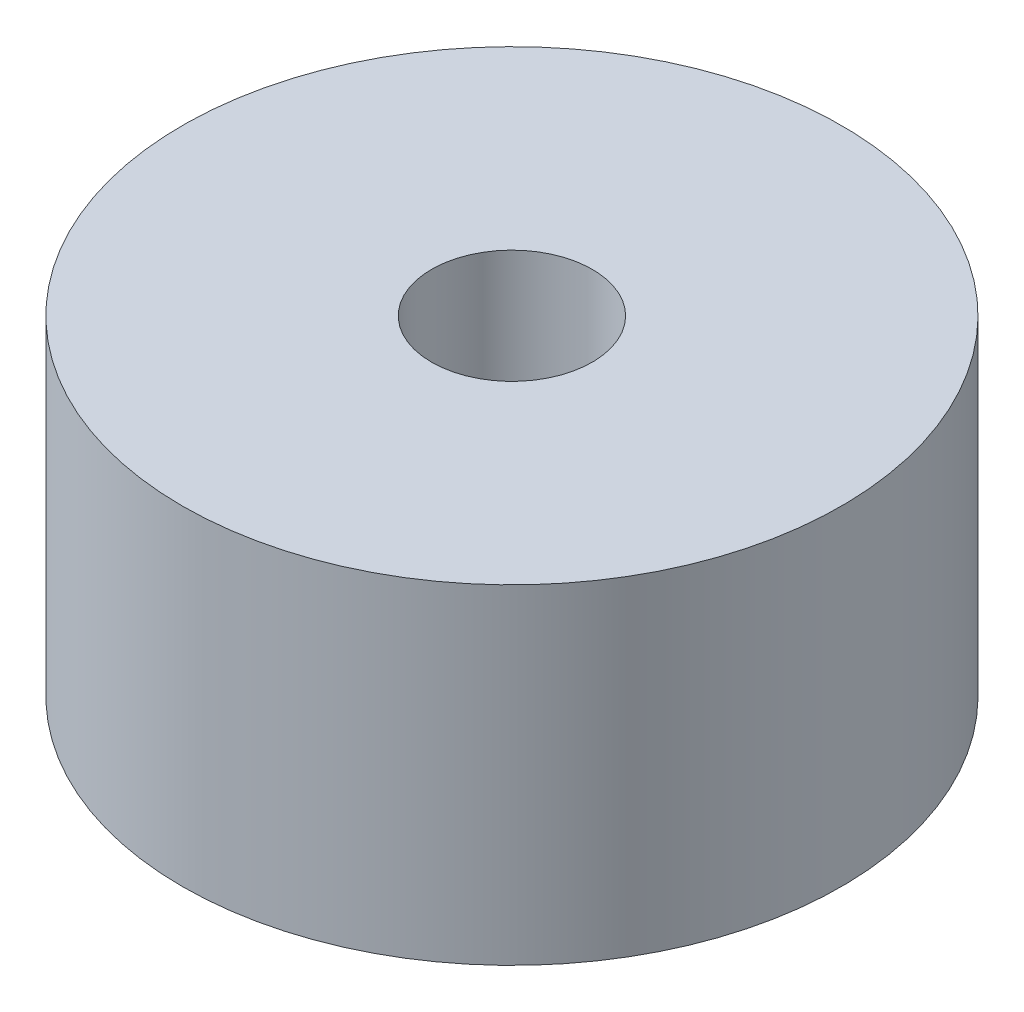
ISO-10303-21;
HEADER;
FILE_DESCRIPTION(('STEP AP214'),'2;1');
FILE_NAME('part.step','',(''),(''),'','','');
FILE_SCHEMA(('AUTOMOTIVE_DESIGN { 1 0 10303 214 1 1 1 1 }'));
ENDSEC;
DATA;
#1=APPLICATION_CONTEXT('core data for automotive mechanical design processes');
#2=APPLICATION_PROTOCOL_DEFINITION('international standard','automotive_design',2000,#1);
#3=PRODUCT_CONTEXT('',#1,'mechanical');
#4=PRODUCT('Part','Part','',(#3));
#5=PRODUCT_RELATED_PRODUCT_CATEGORY('part','',(#4));
#6=PRODUCT_DEFINITION_FORMATION('','',#4);
#7=PRODUCT_DEFINITION_CONTEXT('part definition',#1,'design');
#8=PRODUCT_DEFINITION('design','',#6,#7);
#9=PRODUCT_DEFINITION_SHAPE('','',#8);
#10=(LENGTH_UNIT() NAMED_UNIT(*) SI_UNIT(.MILLI.,.METRE.));
#11=(NAMED_UNIT(*) PLANE_ANGLE_UNIT() SI_UNIT($,.RADIAN.));
#12=(NAMED_UNIT(*) SI_UNIT($,.STERADIAN.) SOLID_ANGLE_UNIT());
#13=UNCERTAINTY_MEASURE_WITH_UNIT(LENGTH_MEASURE(1.E-05),#10,'distance_accuracy_value','');
#14=(GEOMETRIC_REPRESENTATION_CONTEXT(3) GLOBAL_UNCERTAINTY_ASSIGNED_CONTEXT((#13)) GLOBAL_UNIT_ASSIGNED_CONTEXT((#10,
#11,#12)) REPRESENTATION_CONTEXT('',''));
#15=CARTESIAN_POINT('',(0.,0.,0.));
#16=DIRECTION('',(0.,0.,1.));
#17=DIRECTION('',(1.,0.,0.));
#18=AXIS2_PLACEMENT_3D('',#15,#16,#17);
#19=CARTESIAN_POINT('',(0.,6.35,0.));
#20=DIRECTION('',(0.,1.,0.));
#21=DIRECTION('',(0.,0.,1.));
#22=AXIS2_PLACEMENT_3D('',#19,#20,#21);
#23=PLANE('',#22);
#24=CARTESIAN_POINT('',(0.,6.35,0.));
#25=DIRECTION('',(0.,1.,0.));
#26=DIRECTION('',(0.,0.,1.));
#27=AXIS2_PLACEMENT_3D('',#24,#25,#26);
#28=CIRCLE('',#27,6.35);
#29=CARTESIAN_POINT('',(0.,6.35,6.35));
#30=VERTEX_POINT('',#29);
#31=EDGE_CURVE('E10',#30,#30,#28,.T.);
#32=ORIENTED_EDGE('',*,*,#31,.T.);
#33=EDGE_LOOP('',(#32));
#34=FACE_BOUND('',#33,.T.);
#35=CARTESIAN_POINT('',(0.,6.35,0.));
#36=DIRECTION('',(0.,1.,0.));
#37=DIRECTION('',(0.,0.,1.));
#38=AXIS2_PLACEMENT_3D('',#35,#36,#37);
#39=CIRCLE('',#38,1.5494);
#40=CARTESIAN_POINT('',(0.,6.35,1.5494));
#41=VERTEX_POINT('',#40);
#42=EDGE_CURVE('E49',#41,#41,#39,.T.);
#43=ORIENTED_EDGE('',*,*,#42,.F.);
#44=EDGE_LOOP('',(#43));
#45=FACE_BOUND('',#44,.T.);
#46=ADVANCED_FACE('F36',(#34,#45),#23,.T.);
#47=CARTESIAN_POINT('',(0.,0.,0.));
#48=DIRECTION('',(0.,1.,0.));
#49=DIRECTION('',(0.,0.,1.));
#50=AXIS2_PLACEMENT_3D('',#47,#48,#49);
#51=PLANE('',#50);
#52=CARTESIAN_POINT('',(0.,0.,0.));
#53=DIRECTION('',(0.,1.,0.));
#54=DIRECTION('',(0.,0.,1.));
#55=AXIS2_PLACEMENT_3D('',#52,#53,#54);
#56=CIRCLE('',#55,6.35);
#57=CARTESIAN_POINT('',(0.,0.,6.35));
#58=VERTEX_POINT('',#57);
#59=EDGE_CURVE('E40',#58,#58,#56,.T.);
#60=ORIENTED_EDGE('',*,*,#59,.F.);
#61=EDGE_LOOP('',(#60));
#62=FACE_BOUND('',#61,.T.);
#63=CARTESIAN_POINT('',(0.,0.,0.));
#64=DIRECTION('',(0.,1.,0.));
#65=DIRECTION('',(0.,0.,1.));
#66=AXIS2_PLACEMENT_3D('',#63,#64,#65);
#67=CIRCLE('',#66,1.5494);
#68=CARTESIAN_POINT('',(0.,0.,1.5494));
#69=VERTEX_POINT('',#68);
#70=EDGE_CURVE('E51',#69,#69,#67,.T.);
#71=ORIENTED_EDGE('',*,*,#70,.T.);
#72=EDGE_LOOP('',(#71));
#73=FACE_BOUND('',#72,.T.);
#74=ADVANCED_FACE('F63',(#62,#73),#51,.F.);
#75=CARTESIAN_POINT('',(0.,6.35,0.));
#76=DIRECTION('',(0.,-1.,0.));
#77=DIRECTION('',(0.,0.,-1.));
#78=AXIS2_PLACEMENT_3D('',#75,#76,#77);
#79=CYLINDRICAL_SURFACE('',#78,6.35);
#80=ORIENTED_EDGE('',*,*,#31,.F.);
#81=EDGE_LOOP('',(#80));
#82=FACE_BOUND('',#81,.T.);
#83=ORIENTED_EDGE('',*,*,#59,.T.);
#84=EDGE_LOOP('',(#83));
#85=FACE_BOUND('',#84,.T.);
#86=ADVANCED_FACE('F38',(#82,#85),#79,.T.);
#87=CARTESIAN_POINT('',(0.,6.35,0.));
#88=DIRECTION('',(0.,-1.,0.));
#89=DIRECTION('',(0.,0.,-1.));
#90=AXIS2_PLACEMENT_3D('',#87,#88,#89);
#91=CYLINDRICAL_SURFACE('',#90,1.5494);
#92=ORIENTED_EDGE('',*,*,#42,.T.);
#93=EDGE_LOOP('',(#92));
#94=FACE_BOUND('',#93,.T.);
#95=ORIENTED_EDGE('',*,*,#70,.F.);
#96=EDGE_LOOP('',(#95));
#97=FACE_BOUND('',#96,.T.);
#98=ADVANCED_FACE('F59',(#94,#97),#91,.F.);
#99=CLOSED_SHELL('',(#46,#74,#86,#98));
#100=MANIFOLD_SOLID_BREP('B2',#99);
#101=ADVANCED_BREP_SHAPE_REPRESENTATION('',(#18,#100),#14);
#102=SHAPE_DEFINITION_REPRESENTATION(#9,#101);
ENDSEC;
END-ISO-10303-21;
